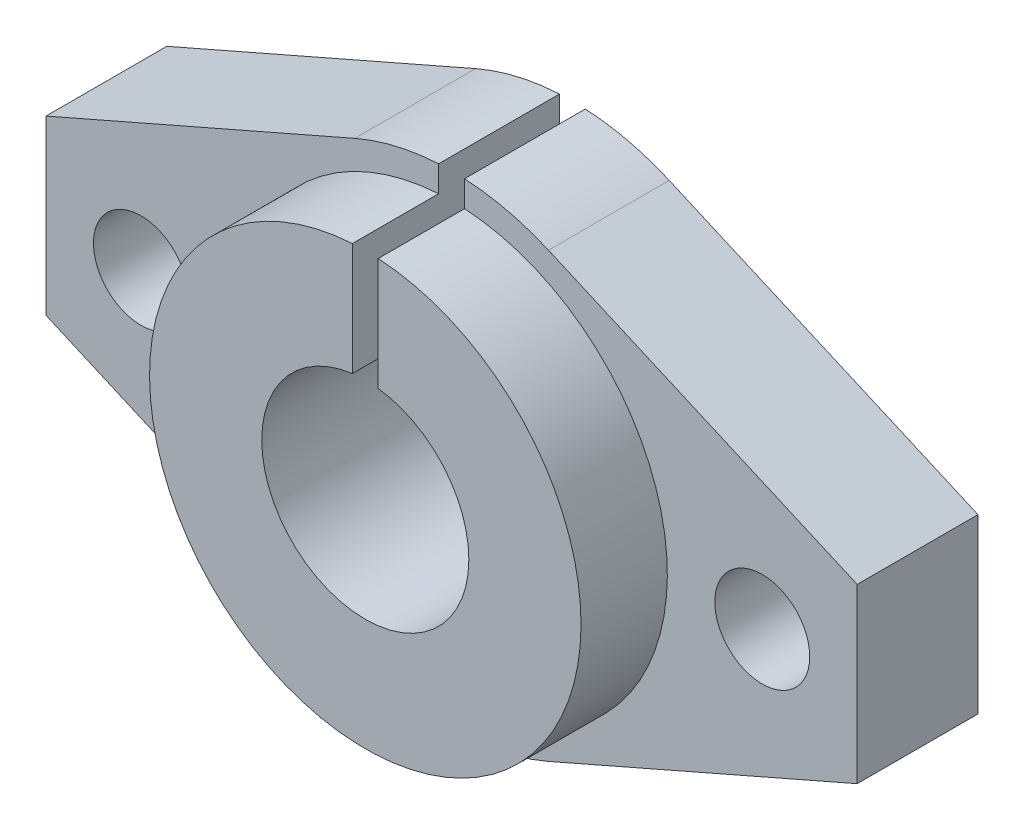
ISO-10303-21;
HEADER;
FILE_DESCRIPTION(('STEP AP214'),'2;1');
FILE_NAME('part.step','',(''),(''),'','','');
FILE_SCHEMA(('AUTOMOTIVE_DESIGN { 1 0 10303 214 1 1 1 1 }'));
ENDSEC;
DATA;
#1=APPLICATION_CONTEXT('core data for automotive mechanical design processes');
#2=APPLICATION_PROTOCOL_DEFINITION('international standard','automotive_design',2000,#1);
#3=PRODUCT_CONTEXT('',#1,'mechanical');
#4=PRODUCT('Part','Part','',(#3));
#5=PRODUCT_RELATED_PRODUCT_CATEGORY('part','',(#4));
#6=PRODUCT_DEFINITION_FORMATION('','',#4);
#7=PRODUCT_DEFINITION_CONTEXT('part definition',#1,'design');
#8=PRODUCT_DEFINITION('design','',#6,#7);
#9=PRODUCT_DEFINITION_SHAPE('','',#8);
#10=(LENGTH_UNIT() NAMED_UNIT(*) SI_UNIT(.MILLI.,.METRE.));
#11=(NAMED_UNIT(*) PLANE_ANGLE_UNIT() SI_UNIT($,.RADIAN.));
#12=(NAMED_UNIT(*) SI_UNIT($,.STERADIAN.) SOLID_ANGLE_UNIT());
#13=UNCERTAINTY_MEASURE_WITH_UNIT(LENGTH_MEASURE(1.E-05),#10,'distance_accuracy_value','');
#14=(GEOMETRIC_REPRESENTATION_CONTEXT(3) GLOBAL_UNCERTAINTY_ASSIGNED_CONTEXT((#13)) GLOBAL_UNIT_ASSIGNED_CONTEXT((#10,
#11,#12)) REPRESENTATION_CONTEXT('',''));
#15=CARTESIAN_POINT('',(0.,0.,0.));
#16=DIRECTION('',(0.,0.,1.));
#17=DIRECTION('',(1.,0.,0.));
#18=AXIS2_PLACEMENT_3D('',#15,#16,#17);
#19=CARTESIAN_POINT('',(0.,0.,7.));
#20=DIRECTION('',(0.,0.,-1.));
#21=DIRECTION('',(-1.,0.,0.));
#22=AXIS2_PLACEMENT_3D('',#19,#20,#21);
#23=CYLINDRICAL_SURFACE('',#22,14.);
#24=CARTESIAN_POINT('',(0.,0.,0.));
#25=DIRECTION('',(0.,0.,1.));
#26=DIRECTION('',(1.,0.,0.));
#27=AXIS2_PLACEMENT_3D('',#24,#25,#26);
#28=CIRCLE('',#27,14.);
#29=CARTESIAN_POINT('',(5.61144444645532,12.82621110166,0.));
#30=VERTEX_POINT('',#29);
#31=CARTESIAN_POINT('',(0.75,13.9798962800158,0.));
#32=VERTEX_POINT('',#31);
#33=EDGE_CURVE('E195',#30,#32,#28,.T.);
#34=ORIENTED_EDGE('',*,*,#33,.T.);
#35=DIRECTION('',(0.,0.,-1.));
#36=VECTOR('',#35,1.);
#37=CARTESIAN_POINT('',(0.749999999999999,13.9798962800158,7.));
#38=LINE('',#37,#36);
#39=CARTESIAN_POINT('',(0.749999999999999,13.9798962800158,7.));
#40=VERTEX_POINT('',#39);
#41=EDGE_CURVE('E242',#32,#40,#38,.F.);
#42=ORIENTED_EDGE('',*,*,#41,.T.);
#43=CARTESIAN_POINT('',(0.,0.,7.));
#44=DIRECTION('',(0.,0.,1.));
#45=DIRECTION('',(1.,0.,0.));
#46=AXIS2_PLACEMENT_3D('',#43,#44,#45);
#47=CIRCLE('',#46,14.);
#48=CARTESIAN_POINT('',(5.61144444645532,12.82621110166,7.));
#49=VERTEX_POINT('',#48);
#50=EDGE_CURVE('E179',#49,#40,#47,.T.);
#51=ORIENTED_EDGE('',*,*,#50,.F.);
#52=DIRECTION('',(0.,0.,-1.));
#53=VECTOR('',#52,1.);
#54=CARTESIAN_POINT('',(5.61144444645532,12.82621110166,7.));
#55=LINE('',#54,#53);
#56=EDGE_CURVE('E204',#49,#30,#55,.T.);
#57=ORIENTED_EDGE('',*,*,#56,.T.);
#58=EDGE_LOOP('',(#34,#42,#51,#57));
#59=FACE_BOUND('',#58,.T.);
#60=ADVANCED_FACE('F33',(#59),#23,.T.);
#61=CARTESIAN_POINT('',(0.,0.,7.));
#62=DIRECTION('',(0.,0.,1.));
#63=DIRECTION('',(1.,0.,0.));
#64=AXIS2_PLACEMENT_3D('',#61,#62,#63);
#65=PLANE('',#64);
#66=DIRECTION('',(0.,1.,0.));
#67=VECTOR('',#66,1.);
#68=CARTESIAN_POINT('',(0.749999999999998,0.,7.));
#69=LINE('',#68,#67);
#70=CARTESIAN_POINT('',(0.749999999999999,12.4774797134678,7.));
#71=VERTEX_POINT('',#70);
#72=EDGE_CURVE('E240',#71,#40,#69,.T.);
#73=ORIENTED_EDGE('',*,*,#72,.F.);
#74=CARTESIAN_POINT('',(0.,0.,7.));
#75=DIRECTION('',(0.,0.,1.));
#76=DIRECTION('',(1.,0.,0.));
#77=AXIS2_PLACEMENT_3D('',#74,#75,#76);
#78=CIRCLE('',#77,12.5);
#79=CARTESIAN_POINT('',(-0.750000000000001,12.4774797134678,7.));
#80=VERTEX_POINT('',#79);
#81=EDGE_CURVE('E154',#80,#71,#78,.T.);
#82=ORIENTED_EDGE('',*,*,#81,.F.);
#83=DIRECTION('',(0.,-1.,0.));
#84=VECTOR('',#83,1.);
#85=CARTESIAN_POINT('',(-0.750000000000002,0.,7.));
#86=LINE('',#85,#84);
#87=CARTESIAN_POINT('',(-0.750000000000001,13.9798962800158,7.));
#88=VERTEX_POINT('',#87);
#89=EDGE_CURVE('E134',#88,#80,#86,.T.);
#90=ORIENTED_EDGE('',*,*,#89,.F.);
#91=CARTESIAN_POINT('',(-5.61144444645532,12.82621110166,7.));
#92=VERTEX_POINT('',#91);
#93=EDGE_CURVE('E178',#88,#92,#47,.T.);
#94=ORIENTED_EDGE('',*,*,#93,.T.);
#95=DIRECTION('',(-0.916157935832856,-0.400817460461095,0.));
#96=VECTOR('',#95,1.);
#97=CARTESIAN_POINT('',(-5.61144444645532,12.82621110166,7.));
#98=LINE('',#97,#96);
#99=CARTESIAN_POINT('',(-23.5,5.,7.));
#100=VERTEX_POINT('',#99);
#101=EDGE_CURVE('E182',#92,#100,#98,.T.);
#102=ORIENTED_EDGE('',*,*,#101,.T.);
#103=DIRECTION('',(0.,-1.,0.));
#104=VECTOR('',#103,1.);
#105=CARTESIAN_POINT('',(-23.5,-5.,7.));
#106=LINE('',#105,#104);
#107=CARTESIAN_POINT('',(-23.5,-5.,7.));
#108=VERTEX_POINT('',#107);
#109=EDGE_CURVE('E164',#100,#108,#106,.T.);
#110=ORIENTED_EDGE('',*,*,#109,.T.);
#111=DIRECTION('',(0.916157935832856,-0.400817460461095,0.));
#112=VECTOR('',#111,1.);
#113=CARTESIAN_POINT('',(-5.61144444645532,-12.82621110166,7.));
#114=LINE('',#113,#112);
#115=CARTESIAN_POINT('',(-5.61144444645533,-12.82621110166,7.));
#116=VERTEX_POINT('',#115);
#117=EDGE_CURVE('E167',#108,#116,#114,.T.);
#118=ORIENTED_EDGE('',*,*,#117,.T.);
#119=CARTESIAN_POINT('',(0.,0.,7.));
#120=DIRECTION('',(0.,0.,1.));
#121=DIRECTION('',(1.,0.,0.));
#122=AXIS2_PLACEMENT_3D('',#119,#120,#121);
#123=CIRCLE('',#122,14.);
#124=CARTESIAN_POINT('',(5.61144444645533,-12.82621110166,7.));
#125=VERTEX_POINT('',#124);
#126=EDGE_CURVE('E170',#116,#125,#123,.T.);
#127=ORIENTED_EDGE('',*,*,#126,.T.);
#128=DIRECTION('',(0.916157935832855,0.400817460461095,0.));
#129=VECTOR('',#128,1.);
#130=CARTESIAN_POINT('',(5.61144444645533,-12.82621110166,7.));
#131=LINE('',#130,#129);
#132=CARTESIAN_POINT('',(23.5,-5.,7.));
#133=VERTEX_POINT('',#132);
#134=EDGE_CURVE('E172',#125,#133,#131,.T.);
#135=ORIENTED_EDGE('',*,*,#134,.T.);
#136=DIRECTION('',(0.,1.,0.));
#137=VECTOR('',#136,1.);
#138=CARTESIAN_POINT('',(23.5,-5.,7.));
#139=LINE('',#138,#137);
#140=CARTESIAN_POINT('',(23.5,5.,7.));
#141=VERTEX_POINT('',#140);
#142=EDGE_CURVE('E174',#133,#141,#139,.T.);
#143=ORIENTED_EDGE('',*,*,#142,.T.);
#144=DIRECTION('',(-0.916157935832856,0.400817460461095,0.));
#145=VECTOR('',#144,1.);
#146=CARTESIAN_POINT('',(5.61144444645532,12.82621110166,7.));
#147=LINE('',#146,#145);
#148=EDGE_CURVE('E176',#141,#49,#147,.T.);
#149=ORIENTED_EDGE('',*,*,#148,.T.);
#150=ORIENTED_EDGE('',*,*,#50,.T.);
#151=EDGE_LOOP('',(#73,#82,#90,#94,#102,#110,#118,#127,#135,#143,#149,#150));
#152=FACE_BOUND('',#151,.T.);
#153=CARTESIAN_POINT('',(18.,0.,7.));
#154=DIRECTION('',(0.,0.,1.));
#155=DIRECTION('',(1.,0.,0.));
#156=AXIS2_PLACEMENT_3D('',#153,#154,#155);
#157=CIRCLE('',#156,2.75);
#158=CARTESIAN_POINT('',(20.75,0.,7.));
#159=VERTEX_POINT('',#158);
#160=EDGE_CURVE('E245',#159,#159,#157,.T.);
#161=ORIENTED_EDGE('',*,*,#160,.F.);
#162=EDGE_LOOP('',(#161));
#163=FACE_BOUND('',#162,.T.);
#164=CARTESIAN_POINT('',(-18.,0.,7.));
#165=DIRECTION('',(0.,0.,1.));
#166=DIRECTION('',(1.,0.,0.));
#167=AXIS2_PLACEMENT_3D('',#164,#165,#166);
#168=CIRCLE('',#167,2.75);
#169=CARTESIAN_POINT('',(-15.25,0.,7.));
#170=VERTEX_POINT('',#169);
#171=EDGE_CURVE('E249',#170,#170,#168,.T.);
#172=ORIENTED_EDGE('',*,*,#171,.F.);
#173=EDGE_LOOP('',(#172));
#174=FACE_BOUND('',#173,.T.);
#175=ADVANCED_FACE('F260',(#152,#163,#174),#65,.T.);
#176=CARTESIAN_POINT('',(-23.5,-5.,7.));
#177=DIRECTION('',(1.,0.,0.));
#178=DIRECTION('',(0.,0.,-1.));
#179=AXIS2_PLACEMENT_3D('',#176,#177,#178);
#180=PLANE('',#179);
#181=DIRECTION('',(0.,-1.,0.));
#182=VECTOR('',#181,1.);
#183=CARTESIAN_POINT('',(-23.5,-5.,0.));
#184=LINE('',#183,#182);
#185=CARTESIAN_POINT('',(-23.5,5.,0.));
#186=VERTEX_POINT('',#185);
#187=CARTESIAN_POINT('',(-23.5,-5.,0.));
#188=VERTEX_POINT('',#187);
#189=EDGE_CURVE('E153',#186,#188,#184,.T.);
#190=ORIENTED_EDGE('',*,*,#189,.T.);
#191=DIRECTION('',(0.,0.,-1.));
#192=VECTOR('',#191,1.);
#193=CARTESIAN_POINT('',(-23.5,-5.,7.));
#194=LINE('',#193,#192);
#195=EDGE_CURVE('E219',#108,#188,#194,.T.);
#196=ORIENTED_EDGE('',*,*,#195,.F.);
#197=ORIENTED_EDGE('',*,*,#109,.F.);
#198=DIRECTION('',(0.,0.,-1.));
#199=VECTOR('',#198,1.);
#200=CARTESIAN_POINT('',(-23.5,5.,7.));
#201=LINE('',#200,#199);
#202=EDGE_CURVE('E183',#100,#186,#201,.T.);
#203=ORIENTED_EDGE('',*,*,#202,.T.);
#204=EDGE_LOOP('',(#190,#196,#197,#203));
#205=FACE_BOUND('',#204,.T.);
#206=ADVANCED_FACE('F35',(#205),#180,.F.);
#207=CARTESIAN_POINT('',(-5.61144444645532,-12.82621110166,7.));
#208=DIRECTION('',(0.400817460461095,0.916157935832856,0.));
#209=DIRECTION('',(-0.916157935832856,0.400817460461095,0.));
#210=AXIS2_PLACEMENT_3D('',#207,#208,#209);
#211=PLANE('',#210);
#212=DIRECTION('',(0.916157935832856,-0.400817460461095,0.));
#213=VECTOR('',#212,1.);
#214=CARTESIAN_POINT('',(-5.61144444645532,-12.82621110166,0.));
#215=LINE('',#214,#213);
#216=CARTESIAN_POINT('',(-5.61144444645533,-12.82621110166,0.));
#217=VERTEX_POINT('',#216);
#218=EDGE_CURVE('E157',#188,#217,#215,.T.);
#219=ORIENTED_EDGE('',*,*,#218,.T.);
#220=DIRECTION('',(0.,0.,-1.));
#221=VECTOR('',#220,1.);
#222=CARTESIAN_POINT('',(-5.61144444645533,-12.82621110166,7.));
#223=LINE('',#222,#221);
#224=EDGE_CURVE('E216',#116,#217,#223,.T.);
#225=ORIENTED_EDGE('',*,*,#224,.F.);
#226=ORIENTED_EDGE('',*,*,#117,.F.);
#227=ORIENTED_EDGE('',*,*,#195,.T.);
#228=EDGE_LOOP('',(#219,#225,#226,#227));
#229=FACE_BOUND('',#228,.T.);
#230=ADVANCED_FACE('F268',(#229),#211,.F.);
#231=CARTESIAN_POINT('',(0.,0.,7.));
#232=DIRECTION('',(0.,0.,-1.));
#233=DIRECTION('',(-1.,0.,0.));
#234=AXIS2_PLACEMENT_3D('',#231,#232,#233);
#235=CYLINDRICAL_SURFACE('',#234,14.);
#236=CARTESIAN_POINT('',(0.,0.,0.));
#237=DIRECTION('',(0.,0.,1.));
#238=DIRECTION('',(1.,0.,0.));
#239=AXIS2_PLACEMENT_3D('',#236,#237,#238);
#240=CIRCLE('',#239,14.);
#241=CARTESIAN_POINT('',(5.61144444645533,-12.82621110166,0.));
#242=VERTEX_POINT('',#241);
#243=EDGE_CURVE('E186',#217,#242,#240,.T.);
#244=ORIENTED_EDGE('',*,*,#243,.T.);
#245=DIRECTION('',(0.,0.,-1.));
#246=VECTOR('',#245,1.);
#247=CARTESIAN_POINT('',(5.61144444645533,-12.82621110166,7.));
#248=LINE('',#247,#246);
#249=EDGE_CURVE('E213',#125,#242,#248,.T.);
#250=ORIENTED_EDGE('',*,*,#249,.F.);
#251=ORIENTED_EDGE('',*,*,#126,.F.);
#252=ORIENTED_EDGE('',*,*,#224,.T.);
#253=EDGE_LOOP('',(#244,#250,#251,#252));
#254=FACE_BOUND('',#253,.T.);
#255=ADVANCED_FACE('F298',(#254),#235,.T.);
#256=CARTESIAN_POINT('',(5.61144444645533,-12.82621110166,7.));
#257=DIRECTION('',(-0.400817460461095,0.916157935832855,0.));
#258=DIRECTION('',(-0.916157935832856,-0.400817460461095,0.));
#259=AXIS2_PLACEMENT_3D('',#256,#257,#258);
#260=PLANE('',#259);
#261=DIRECTION('',(0.916157935832855,0.400817460461095,0.));
#262=VECTOR('',#261,1.);
#263=CARTESIAN_POINT('',(5.61144444645533,-12.82621110166,0.));
#264=LINE('',#263,#262);
#265=CARTESIAN_POINT('',(23.5,-5.,0.));
#266=VERTEX_POINT('',#265);
#267=EDGE_CURVE('E188',#242,#266,#264,.T.);
#268=ORIENTED_EDGE('',*,*,#267,.T.);
#269=DIRECTION('',(0.,0.,-1.));
#270=VECTOR('',#269,1.);
#271=CARTESIAN_POINT('',(23.5,-5.,7.));
#272=LINE('',#271,#270);
#273=EDGE_CURVE('E210',#133,#266,#272,.T.);
#274=ORIENTED_EDGE('',*,*,#273,.F.);
#275=ORIENTED_EDGE('',*,*,#134,.F.);
#276=ORIENTED_EDGE('',*,*,#249,.T.);
#277=EDGE_LOOP('',(#268,#274,#275,#276));
#278=FACE_BOUND('',#277,.T.);
#279=ADVANCED_FACE('F294',(#278),#260,.F.);
#280=CARTESIAN_POINT('',(23.5,-5.,7.));
#281=DIRECTION('',(-1.,0.,0.));
#282=DIRECTION('',(0.,0.,1.));
#283=AXIS2_PLACEMENT_3D('',#280,#281,#282);
#284=PLANE('',#283);
#285=DIRECTION('',(0.,1.,0.));
#286=VECTOR('',#285,1.);
#287=CARTESIAN_POINT('',(23.5,-5.,0.));
#288=LINE('',#287,#286);
#289=CARTESIAN_POINT('',(23.5,5.,0.));
#290=VERTEX_POINT('',#289);
#291=EDGE_CURVE('E190',#266,#290,#288,.T.);
#292=ORIENTED_EDGE('',*,*,#291,.T.);
#293=DIRECTION('',(0.,0.,-1.));
#294=VECTOR('',#293,1.);
#295=CARTESIAN_POINT('',(23.5,5.,7.));
#296=LINE('',#295,#294);
#297=EDGE_CURVE('E207',#141,#290,#296,.T.);
#298=ORIENTED_EDGE('',*,*,#297,.F.);
#299=ORIENTED_EDGE('',*,*,#142,.F.);
#300=ORIENTED_EDGE('',*,*,#273,.T.);
#301=EDGE_LOOP('',(#292,#298,#299,#300));
#302=FACE_BOUND('',#301,.T.);
#303=ADVANCED_FACE('F290',(#302),#284,.F.);
#304=CARTESIAN_POINT('',(5.61144444645532,12.82621110166,7.));
#305=DIRECTION('',(-0.400817460461094,-0.916157935832856,0.));
#306=DIRECTION('',(0.916157935832856,-0.400817460461095,0.));
#307=AXIS2_PLACEMENT_3D('',#304,#305,#306);
#308=PLANE('',#307);
#309=DIRECTION('',(-0.916157935832856,0.400817460461095,0.));
#310=VECTOR('',#309,1.);
#311=CARTESIAN_POINT('',(5.61144444645532,12.82621110166,0.));
#312=LINE('',#311,#310);
#313=EDGE_CURVE('E192',#290,#30,#312,.T.);
#314=ORIENTED_EDGE('',*,*,#313,.T.);
#315=ORIENTED_EDGE('',*,*,#56,.F.);
#316=ORIENTED_EDGE('',*,*,#148,.F.);
#317=ORIENTED_EDGE('',*,*,#297,.T.);
#318=EDGE_LOOP('',(#314,#315,#316,#317));
#319=FACE_BOUND('',#318,.T.);
#320=ADVANCED_FACE('F286',(#319),#308,.F.);
#321=ORIENTED_EDGE('',*,*,#93,.F.);
#322=DIRECTION('',(0.,0.,-1.));
#323=VECTOR('',#322,1.);
#324=CARTESIAN_POINT('',(-0.750000000000001,13.9798962800158,7.));
#325=LINE('',#324,#323);
#326=CARTESIAN_POINT('',(-0.75,13.9798962800158,0.));
#327=VERTEX_POINT('',#326);
#328=EDGE_CURVE('E237',#88,#327,#325,.T.);
#329=ORIENTED_EDGE('',*,*,#328,.T.);
#330=CARTESIAN_POINT('',(-5.61144444645532,12.82621110166,0.));
#331=VERTEX_POINT('',#330);
#332=EDGE_CURVE('E194',#327,#331,#28,.T.);
#333=ORIENTED_EDGE('',*,*,#332,.T.);
#334=DIRECTION('',(0.,0.,-1.));
#335=VECTOR('',#334,1.);
#336=CARTESIAN_POINT('',(-5.61144444645532,12.82621110166,7.));
#337=LINE('',#336,#335);
#338=EDGE_CURVE('E201',#92,#331,#337,.T.);
#339=ORIENTED_EDGE('',*,*,#338,.F.);
#340=EDGE_LOOP('',(#321,#329,#333,#339));
#341=FACE_BOUND('',#340,.T.);
#342=ADVANCED_FACE('F272',(#341),#23,.T.);
#343=CARTESIAN_POINT('',(-5.61144444645532,12.82621110166,7.));
#344=DIRECTION('',(0.400817460461095,-0.916157935832856,0.));
#345=DIRECTION('',(0.916157935832856,0.400817460461095,0.));
#346=AXIS2_PLACEMENT_3D('',#343,#344,#345);
#347=PLANE('',#346);
#348=DIRECTION('',(-0.916157935832856,-0.400817460461095,0.));
#349=VECTOR('',#348,1.);
#350=CARTESIAN_POINT('',(-5.61144444645532,12.82621110166,0.));
#351=LINE('',#350,#349);
#352=EDGE_CURVE('E168',#331,#186,#351,.T.);
#353=ORIENTED_EDGE('',*,*,#352,.T.);
#354=ORIENTED_EDGE('',*,*,#202,.F.);
#355=ORIENTED_EDGE('',*,*,#101,.F.);
#356=ORIENTED_EDGE('',*,*,#338,.T.);
#357=EDGE_LOOP('',(#353,#354,#355,#356));
#358=FACE_BOUND('',#357,.T.);
#359=ADVANCED_FACE('F280',(#358),#347,.F.);
#360=CARTESIAN_POINT('',(0.,0.,0.));
#361=DIRECTION('',(0.,0.,1.));
#362=DIRECTION('',(1.,0.,0.));
#363=AXIS2_PLACEMENT_3D('',#360,#361,#362);
#364=PLANE('',#363);
#365=CARTESIAN_POINT('',(18.,0.,0.));
#366=DIRECTION('',(0.,0.,1.));
#367=DIRECTION('',(1.,0.,0.));
#368=AXIS2_PLACEMENT_3D('',#365,#366,#367);
#369=CIRCLE('',#368,2.75);
#370=CARTESIAN_POINT('',(20.75,0.,0.));
#371=VERTEX_POINT('',#370);
#372=EDGE_CURVE('E246',#371,#371,#369,.T.);
#373=ORIENTED_EDGE('',*,*,#372,.T.);
#374=EDGE_LOOP('',(#373));
#375=FACE_BOUND('',#374,.T.);
#376=CARTESIAN_POINT('',(-18.,0.,0.));
#377=DIRECTION('',(0.,0.,1.));
#378=DIRECTION('',(1.,0.,0.));
#379=AXIS2_PLACEMENT_3D('',#376,#377,#378);
#380=CIRCLE('',#379,2.75);
#381=CARTESIAN_POINT('',(-15.25,0.,0.));
#382=VERTEX_POINT('',#381);
#383=EDGE_CURVE('E252',#382,#382,#380,.T.);
#384=ORIENTED_EDGE('',*,*,#383,.T.);
#385=EDGE_LOOP('',(#384));
#386=FACE_BOUND('',#385,.T.);
#387=CARTESIAN_POINT('',(0.,0.,0.));
#388=DIRECTION('',(0.,0.,1.));
#389=DIRECTION('',(1.,0.,0.));
#390=AXIS2_PLACEMENT_3D('',#387,#388,#389);
#391=CIRCLE('',#390,6.);
#392=CARTESIAN_POINT('',(-0.750000000000001,5.95294044989533,0.));
#393=VERTEX_POINT('',#392);
#394=CARTESIAN_POINT('',(0.749999999999999,5.95294044989533,0.));
#395=VERTEX_POINT('',#394);
#396=EDGE_CURVE('E159',#393,#395,#391,.T.);
#397=ORIENTED_EDGE('',*,*,#396,.T.);
#398=DIRECTION('',(0.,1.,0.));
#399=VECTOR('',#398,1.);
#400=CARTESIAN_POINT('',(0.750000000000001,25.,0.));
#401=LINE('',#400,#399);
#402=EDGE_CURVE('E56',#395,#32,#401,.T.);
#403=ORIENTED_EDGE('',*,*,#402,.T.);
#404=ORIENTED_EDGE('',*,*,#33,.F.);
#405=ORIENTED_EDGE('',*,*,#313,.F.);
#406=ORIENTED_EDGE('',*,*,#291,.F.);
#407=ORIENTED_EDGE('',*,*,#267,.F.);
#408=ORIENTED_EDGE('',*,*,#243,.F.);
#409=ORIENTED_EDGE('',*,*,#218,.F.);
#410=ORIENTED_EDGE('',*,*,#189,.F.);
#411=ORIENTED_EDGE('',*,*,#352,.F.);
#412=ORIENTED_EDGE('',*,*,#332,.F.);
#413=DIRECTION('',(0.,-1.,0.));
#414=VECTOR('',#413,1.);
#415=CARTESIAN_POINT('',(-0.749999999999999,25.,0.));
#416=LINE('',#415,#414);
#417=EDGE_CURVE('E226',#327,#393,#416,.T.);
#418=ORIENTED_EDGE('',*,*,#417,.T.);
#419=EDGE_LOOP('',(#397,#403,#404,#405,#406,#407,#408,#409,#410,#411,#412,#418));
#420=FACE_BOUND('',#419,.T.);
#421=ADVANCED_FACE('F230',(#375,#386,#420),#364,.F.);
#422=CARTESIAN_POINT('',(0.,0.,12.));
#423=DIRECTION('',(0.,0.,-1.));
#424=DIRECTION('',(-1.,0.,0.));
#425=AXIS2_PLACEMENT_3D('',#422,#423,#424);
#426=CYLINDRICAL_SURFACE('',#425,12.5);
#427=ORIENTED_EDGE('',*,*,#81,.T.);
#428=DIRECTION('',(0.,0.,-1.));
#429=VECTOR('',#428,1.);
#430=CARTESIAN_POINT('',(0.749999999999999,12.4774797134678,12.));
#431=LINE('',#430,#429);
#432=CARTESIAN_POINT('',(0.749999999999999,12.4774797134678,12.));
#433=VERTEX_POINT('',#432);
#434=EDGE_CURVE('E152',#71,#433,#431,.F.);
#435=ORIENTED_EDGE('',*,*,#434,.T.);
#436=CARTESIAN_POINT('',(0.,0.,12.));
#437=DIRECTION('',(0.,0.,1.));
#438=DIRECTION('',(1.,0.,0.));
#439=AXIS2_PLACEMENT_3D('',#436,#437,#438);
#440=CIRCLE('',#439,12.5);
#441=CARTESIAN_POINT('',(-0.750000000000001,12.4774797134678,12.));
#442=VERTEX_POINT('',#441);
#443=EDGE_CURVE('E145',#442,#433,#440,.T.);
#444=ORIENTED_EDGE('',*,*,#443,.F.);
#445=DIRECTION('',(0.,0.,-1.));
#446=VECTOR('',#445,1.);
#447=CARTESIAN_POINT('',(-0.750000000000001,12.4774797134678,12.));
#448=LINE('',#447,#446);
#449=EDGE_CURVE('E131',#442,#80,#448,.T.);
#450=ORIENTED_EDGE('',*,*,#449,.T.);
#451=EDGE_LOOP('',(#427,#435,#444,#450));
#452=FACE_BOUND('',#451,.T.);
#453=ADVANCED_FACE('F151',(#452),#426,.T.);
#454=CARTESIAN_POINT('',(0.,0.,12.));
#455=DIRECTION('',(0.,0.,1.));
#456=DIRECTION('',(1.,0.,0.));
#457=AXIS2_PLACEMENT_3D('',#454,#455,#456);
#458=PLANE('',#457);
#459=DIRECTION('',(0.,1.,0.));
#460=VECTOR('',#459,1.);
#461=CARTESIAN_POINT('',(0.750000000000001,25.,12.));
#462=LINE('',#461,#460);
#463=CARTESIAN_POINT('',(0.749999999999999,5.95294044989533,12.));
#464=VERTEX_POINT('',#463);
#465=EDGE_CURVE('E148',#464,#433,#462,.T.);
#466=ORIENTED_EDGE('',*,*,#465,.F.);
#467=CARTESIAN_POINT('',(0.,0.,12.));
#468=DIRECTION('',(0.,0.,1.));
#469=DIRECTION('',(1.,0.,0.));
#470=AXIS2_PLACEMENT_3D('',#467,#468,#469);
#471=CIRCLE('',#470,6.);
#472=CARTESIAN_POINT('',(-0.750000000000001,5.95294044989533,12.));
#473=VERTEX_POINT('',#472);
#474=EDGE_CURVE('E147',#473,#464,#471,.T.);
#475=ORIENTED_EDGE('',*,*,#474,.F.);
#476=DIRECTION('',(0.,-1.,0.));
#477=VECTOR('',#476,1.);
#478=CARTESIAN_POINT('',(-0.749999999999999,25.,12.));
#479=LINE('',#478,#477);
#480=EDGE_CURVE('E48',#442,#473,#479,.T.);
#481=ORIENTED_EDGE('',*,*,#480,.F.);
#482=ORIENTED_EDGE('',*,*,#443,.T.);
#483=EDGE_LOOP('',(#466,#475,#481,#482));
#484=FACE_BOUND('',#483,.T.);
#485=ADVANCED_FACE('F144',(#484),#458,.T.);
#486=CARTESIAN_POINT('',(0.,0.,0.));
#487=DIRECTION('',(0.,0.,1.));
#488=DIRECTION('',(1.,0.,0.));
#489=AXIS2_PLACEMENT_3D('',#486,#487,#488);
#490=CYLINDRICAL_SURFACE('',#489,6.);
#491=ORIENTED_EDGE('',*,*,#474,.T.);
#492=DIRECTION('',(0.,0.,1.));
#493=VECTOR('',#492,1.);
#494=CARTESIAN_POINT('',(0.749999999999999,5.95294044989533,0.));
#495=LINE('',#494,#493);
#496=EDGE_CURVE('E11',#464,#395,#495,.F.);
#497=ORIENTED_EDGE('',*,*,#496,.T.);
#498=ORIENTED_EDGE('',*,*,#396,.F.);
#499=DIRECTION('',(0.,0.,1.));
#500=VECTOR('',#499,1.);
#501=CARTESIAN_POINT('',(-0.750000000000001,5.95294044989533,0.));
#502=LINE('',#501,#500);
#503=EDGE_CURVE('E41',#393,#473,#502,.T.);
#504=ORIENTED_EDGE('',*,*,#503,.T.);
#505=EDGE_LOOP('',(#491,#497,#498,#504));
#506=FACE_BOUND('',#505,.T.);
#507=ADVANCED_FACE('F223',(#506),#490,.F.);
#508=CARTESIAN_POINT('',(-18.,0.,0.));
#509=DIRECTION('',(0.,0.,1.));
#510=DIRECTION('',(1.,0.,0.));
#511=AXIS2_PLACEMENT_3D('',#508,#509,#510);
#512=CYLINDRICAL_SURFACE('',#511,2.75);
#513=ORIENTED_EDGE('',*,*,#383,.F.);
#514=EDGE_LOOP('',(#513));
#515=FACE_BOUND('',#514,.T.);
#516=ORIENTED_EDGE('',*,*,#171,.T.);
#517=EDGE_LOOP('',(#516));
#518=FACE_BOUND('',#517,.T.);
#519=ADVANCED_FACE('F258',(#515,#518),#512,.F.);
#520=CARTESIAN_POINT('',(18.,0.,0.));
#521=DIRECTION('',(0.,0.,1.));
#522=DIRECTION('',(1.,0.,0.));
#523=AXIS2_PLACEMENT_3D('',#520,#521,#522);
#524=CYLINDRICAL_SURFACE('',#523,2.75);
#525=ORIENTED_EDGE('',*,*,#372,.F.);
#526=EDGE_LOOP('',(#525));
#527=FACE_BOUND('',#526,.T.);
#528=ORIENTED_EDGE('',*,*,#160,.T.);
#529=EDGE_LOOP('',(#528));
#530=FACE_BOUND('',#529,.T.);
#531=ADVANCED_FACE('F334',(#527,#530),#524,.F.);
#532=CARTESIAN_POINT('',(-0.749999999999999,25.,0.));
#533=DIRECTION('',(-1.,0.,0.));
#534=DIRECTION('',(0.,-1.,0.));
#535=AXIS2_PLACEMENT_3D('',#532,#533,#534);
#536=PLANE('',#535);
#537=ORIENTED_EDGE('',*,*,#89,.T.);
#538=ORIENTED_EDGE('',*,*,#449,.F.);
#539=ORIENTED_EDGE('',*,*,#480,.T.);
#540=ORIENTED_EDGE('',*,*,#503,.F.);
#541=ORIENTED_EDGE('',*,*,#417,.F.);
#542=ORIENTED_EDGE('',*,*,#328,.F.);
#543=EDGE_LOOP('',(#537,#538,#539,#540,#541,#542));
#544=FACE_BOUND('',#543,.T.);
#545=ADVANCED_FACE('F132',(#544),#536,.F.);
#546=CARTESIAN_POINT('',(0.750000000000001,25.,0.));
#547=DIRECTION('',(1.,0.,0.));
#548=DIRECTION('',(0.,1.,0.));
#549=AXIS2_PLACEMENT_3D('',#546,#547,#548);
#550=PLANE('',#549);
#551=ORIENTED_EDGE('',*,*,#402,.F.);
#552=ORIENTED_EDGE('',*,*,#496,.F.);
#553=ORIENTED_EDGE('',*,*,#465,.T.);
#554=ORIENTED_EDGE('',*,*,#434,.F.);
#555=ORIENTED_EDGE('',*,*,#72,.T.);
#556=ORIENTED_EDGE('',*,*,#41,.F.);
#557=EDGE_LOOP('',(#551,#552,#553,#554,#555,#556));
#558=FACE_BOUND('',#557,.T.);
#559=ADVANCED_FACE('F327',(#558),#550,.F.);
#560=CLOSED_SHELL('',(#60,#175,#206,#230,#255,#279,#303,#320,#342,#359,#421,#453,#485,#507,#519,
#531,#545,#559));
#561=MANIFOLD_SOLID_BREP('B2',#560);
#562=ADVANCED_BREP_SHAPE_REPRESENTATION('',(#18,#561),#14);
#563=SHAPE_DEFINITION_REPRESENTATION(#9,#562);
ENDSEC;
END-ISO-10303-21;
